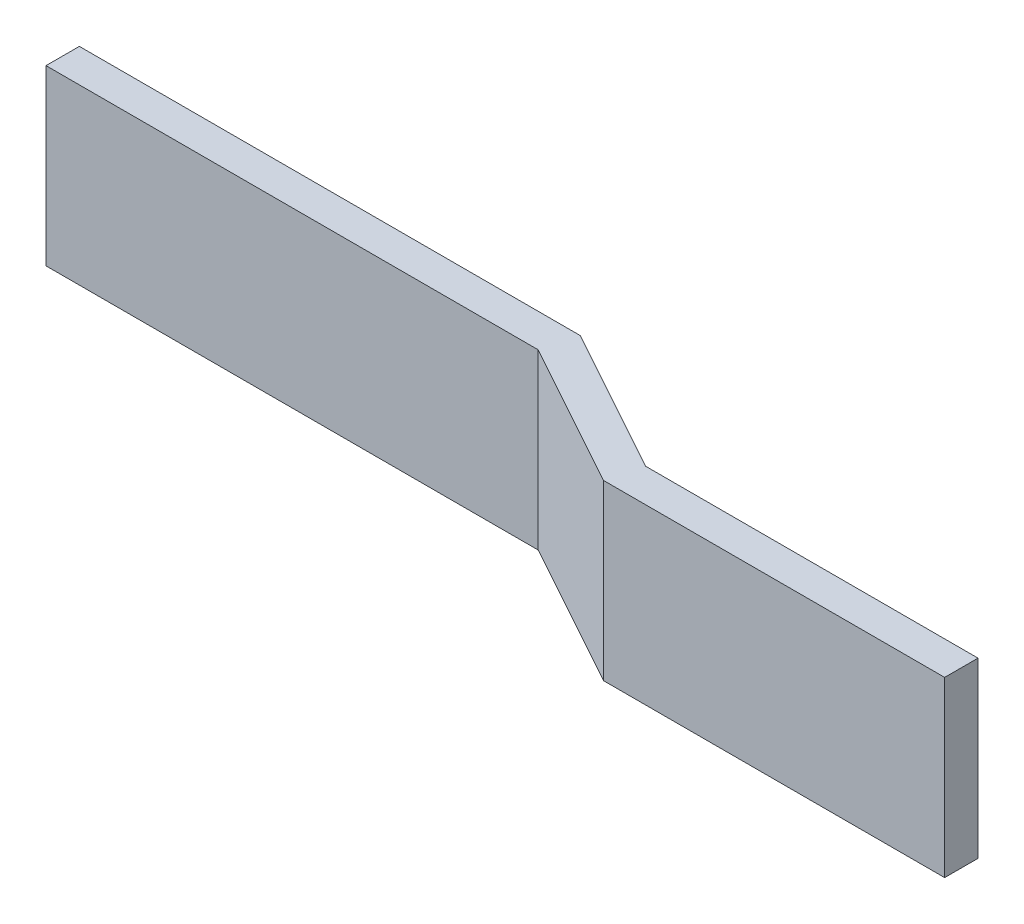
ISO-10303-21;
HEADER;
FILE_DESCRIPTION(('STEP AP214'),'2;1');
FILE_NAME('part.step','',(''),(''),'','','');
FILE_SCHEMA(('AUTOMOTIVE_DESIGN { 1 0 10303 214 1 1 1 1 }'));
ENDSEC;
DATA;
#1=APPLICATION_CONTEXT('core data for automotive mechanical design processes');
#2=APPLICATION_PROTOCOL_DEFINITION('international standard','automotive_design',2000,#1);
#3=PRODUCT_CONTEXT('',#1,'mechanical');
#4=PRODUCT('Part','Part','',(#3));
#5=PRODUCT_RELATED_PRODUCT_CATEGORY('part','',(#4));
#6=PRODUCT_DEFINITION_FORMATION('','',#4);
#7=PRODUCT_DEFINITION_CONTEXT('part definition',#1,'design');
#8=PRODUCT_DEFINITION('design','',#6,#7);
#9=PRODUCT_DEFINITION_SHAPE('','',#8);
#10=(LENGTH_UNIT() NAMED_UNIT(*) SI_UNIT(.MILLI.,.METRE.));
#11=(NAMED_UNIT(*) PLANE_ANGLE_UNIT() SI_UNIT($,.RADIAN.));
#12=(NAMED_UNIT(*) SI_UNIT($,.STERADIAN.) SOLID_ANGLE_UNIT());
#13=UNCERTAINTY_MEASURE_WITH_UNIT(LENGTH_MEASURE(1.E-05),#10,'distance_accuracy_value','');
#14=(GEOMETRIC_REPRESENTATION_CONTEXT(3) GLOBAL_UNCERTAINTY_ASSIGNED_CONTEXT((#13)) GLOBAL_UNIT_ASSIGNED_CONTEXT((#10,
#11,#12)) REPRESENTATION_CONTEXT('',''));
#15=CARTESIAN_POINT('',(0.,0.,0.));
#16=DIRECTION('',(0.,0.,1.));
#17=DIRECTION('',(1.,0.,0.));
#18=AXIS2_PLACEMENT_3D('',#15,#16,#17);
#19=CARTESIAN_POINT('',(49.2452703940796,13.208,8.66886869750178));
#20=DIRECTION('',(0.,0.,-1.));
#21=DIRECTION('',(-1.,0.,0.));
#22=AXIS2_PLACEMENT_3D('',#19,#20,#21);
#23=PLANE('',#22);
#24=DIRECTION('',(1.,0.,0.));
#25=VECTOR('',#24,1.);
#26=CARTESIAN_POINT('',(49.2452703940796,0.,8.66886869750178));
#27=LINE('',#26,#25);
#28=CARTESIAN_POINT('',(48.5909413517748,0.,8.66886869750178));
#29=VERTEX_POINT('',#28);
#30=CARTESIAN_POINT('',(74.5674344132872,0.,8.66886869750178));
#31=VERTEX_POINT('',#30);
#32=EDGE_CURVE('E141',#29,#31,#27,.T.);
#33=ORIENTED_EDGE('',*,*,#32,.T.);
#34=DIRECTION('',(0.,-1.,0.));
#35=VECTOR('',#34,1.);
#36=CARTESIAN_POINT('',(74.5674344132872,13.208,8.66886869750178));
#37=LINE('',#36,#35);
#38=CARTESIAN_POINT('',(74.5674344132872,13.208,8.66886869750178));
#39=VERTEX_POINT('',#38);
#40=EDGE_CURVE('E11',#39,#31,#37,.T.);
#41=ORIENTED_EDGE('',*,*,#40,.F.);
#42=DIRECTION('',(1.,0.,0.));
#43=VECTOR('',#42,1.);
#44=CARTESIAN_POINT('',(49.2452703940796,13.208,8.66886869750178));
#45=LINE('',#44,#43);
#46=CARTESIAN_POINT('',(48.5909413517748,13.208,8.66886869750178));
#47=VERTEX_POINT('',#46);
#48=EDGE_CURVE('E94',#47,#39,#45,.T.);
#49=ORIENTED_EDGE('',*,*,#48,.F.);
#50=DIRECTION('',(0.,-1.,0.));
#51=VECTOR('',#50,1.);
#52=CARTESIAN_POINT('',(48.5909413517748,13.208,8.66886869750178));
#53=LINE('',#52,#51);
#54=EDGE_CURVE('E140',#47,#29,#53,.T.);
#55=ORIENTED_EDGE('',*,*,#54,.T.);
#56=EDGE_LOOP('',(#33,#41,#49,#55));
#57=FACE_BOUND('',#56,.T.);
#58=ADVANCED_FACE('F38',(#57),#23,.F.);
#59=CARTESIAN_POINT('',(74.5674344132872,13.208,6.12886869750177));
#60=DIRECTION('',(1.,0.,0.));
#61=DIRECTION('',(0.,0.,-1.));
#62=AXIS2_PLACEMENT_3D('',#59,#60,#61);
#63=PLANE('',#62);
#64=DIRECTION('',(0.,0.,1.));
#65=VECTOR('',#64,1.);
#66=CARTESIAN_POINT('',(74.5674344132872,0.,6.12886869750177));
#67=LINE('',#66,#65);
#68=CARTESIAN_POINT('',(74.5674344132872,0.,6.12886869750177));
#69=VERTEX_POINT('',#68);
#70=EDGE_CURVE('E145',#69,#31,#67,.T.);
#71=ORIENTED_EDGE('',*,*,#70,.F.);
#72=DIRECTION('',(0.,-1.,0.));
#73=VECTOR('',#72,1.);
#74=CARTESIAN_POINT('',(74.5674344132872,13.208,6.12886869750177));
#75=LINE('',#74,#73);
#76=CARTESIAN_POINT('',(74.5674344132872,13.208,6.12886869750177));
#77=VERTEX_POINT('',#76);
#78=EDGE_CURVE('E47',#77,#69,#75,.T.);
#79=ORIENTED_EDGE('',*,*,#78,.F.);
#80=DIRECTION('',(0.,0.,1.));
#81=VECTOR('',#80,1.);
#82=CARTESIAN_POINT('',(74.5674344132872,13.208,6.12886869750177));
#83=LINE('',#82,#81);
#84=EDGE_CURVE('E198',#77,#39,#83,.T.);
#85=ORIENTED_EDGE('',*,*,#84,.T.);
#86=ORIENTED_EDGE('',*,*,#40,.T.);
#87=EDGE_LOOP('',(#71,#79,#85,#86));
#88=FACE_BOUND('',#87,.T.);
#89=ADVANCED_FACE('F189',(#88),#63,.T.);
#90=CARTESIAN_POINT('',(49.2452703940796,13.208,6.12886869750177));
#91=DIRECTION('',(0.,0.,-1.));
#92=DIRECTION('',(-1.,0.,0.));
#93=AXIS2_PLACEMENT_3D('',#90,#91,#92);
#94=PLANE('',#93);
#95=DIRECTION('',(1.,0.,0.));
#96=VECTOR('',#95,1.);
#97=CARTESIAN_POINT('',(49.2452703940796,0.,6.12886869750177));
#98=LINE('',#97,#96);
#99=CARTESIAN_POINT('',(49.2452703940796,0.,6.12886869750177));
#100=VERTEX_POINT('',#99);
#101=EDGE_CURVE('E150',#100,#69,#98,.T.);
#102=ORIENTED_EDGE('',*,*,#101,.F.);
#103=DIRECTION('',(0.,-1.,0.));
#104=VECTOR('',#103,1.);
#105=CARTESIAN_POINT('',(49.2452703940796,13.208,6.12886869750177));
#106=LINE('',#105,#104);
#107=CARTESIAN_POINT('',(49.2452703940796,13.208,6.12886869750177));
#108=VERTEX_POINT('',#107);
#109=EDGE_CURVE('E177',#108,#100,#106,.T.);
#110=ORIENTED_EDGE('',*,*,#109,.F.);
#111=DIRECTION('',(1.,0.,0.));
#112=VECTOR('',#111,1.);
#113=CARTESIAN_POINT('',(49.2452703940796,13.208,6.12886869750177));
#114=LINE('',#113,#112);
#115=EDGE_CURVE('E186',#108,#77,#114,.T.);
#116=ORIENTED_EDGE('',*,*,#115,.T.);
#117=ORIENTED_EDGE('',*,*,#78,.T.);
#118=EDGE_LOOP('',(#102,#110,#116,#117));
#119=FACE_BOUND('',#118,.T.);
#120=ADVANCED_FACE('F184',(#119),#94,.T.);
#121=CARTESIAN_POINT('',(38.1390581049535,13.208,0.));
#122=DIRECTION('',(0.483156107137484,0.,-0.875534223280708));
#123=DIRECTION('',(-0.875534223280708,0.,-0.483156107137484));
#124=AXIS2_PLACEMENT_3D('',#121,#122,#123);
#125=PLANE('',#124);
#126=DIRECTION('',(0.875534223280708,0.,0.483156107137484));
#127=VECTOR('',#126,1.);
#128=CARTESIAN_POINT('',(38.1390581049535,0.,0.));
#129=LINE('',#128,#127);
#130=CARTESIAN_POINT('',(38.1390581049535,0.,0.));
#131=VERTEX_POINT('',#130);
#132=EDGE_CURVE('E154',#131,#100,#129,.T.);
#133=ORIENTED_EDGE('',*,*,#132,.F.);
#134=DIRECTION('',(0.,-1.,0.));
#135=VECTOR('',#134,1.);
#136=CARTESIAN_POINT('',(38.1390581049535,13.208,0.));
#137=LINE('',#136,#135);
#138=CARTESIAN_POINT('',(38.1390581049535,13.208,0.));
#139=VERTEX_POINT('',#138);
#140=EDGE_CURVE('E174',#139,#131,#137,.T.);
#141=ORIENTED_EDGE('',*,*,#140,.F.);
#142=DIRECTION('',(0.875534223280708,0.,0.483156107137484));
#143=VECTOR('',#142,1.);
#144=CARTESIAN_POINT('',(38.1390581049535,13.208,0.));
#145=LINE('',#144,#143);
#146=EDGE_CURVE('E134',#139,#108,#145,.T.);
#147=ORIENTED_EDGE('',*,*,#146,.T.);
#148=ORIENTED_EDGE('',*,*,#109,.T.);
#149=EDGE_LOOP('',(#133,#141,#147,#148));
#150=FACE_BOUND('',#149,.T.);
#151=ADVANCED_FACE('F196',(#150),#125,.T.);
#152=CARTESIAN_POINT('',(0.,13.208,0.));
#153=DIRECTION('',(0.,0.,-1.));
#154=DIRECTION('',(-1.,0.,0.));
#155=AXIS2_PLACEMENT_3D('',#152,#153,#154);
#156=PLANE('',#155);
#157=CARTESIAN_POINT('',(6.11062579811326,6.604,0.));
#158=DIRECTION('',(0.,0.,-1.));
#159=DIRECTION('',(-1.,0.,0.));
#160=AXIS2_PLACEMENT_3D('',#157,#158,#159);
#161=CIRCLE('',#160,3.048);
#162=CARTESIAN_POINT('',(3.06262579811326,6.604,0.));
#163=VERTEX_POINT('',#162);
#164=EDGE_CURVE('E207',#163,#163,#161,.T.);
#165=ORIENTED_EDGE('',*,*,#164,.F.);
#166=EDGE_LOOP('',(#165));
#167=FACE_BOUND('',#166,.T.);
#168=DIRECTION('',(1.,0.,0.));
#169=VECTOR('',#168,1.);
#170=CARTESIAN_POINT('',(0.,0.,0.));
#171=LINE('',#170,#169);
#172=CARTESIAN_POINT('',(0.,0.,0.));
#173=VERTEX_POINT('',#172);
#174=EDGE_CURVE('E158',#173,#131,#171,.T.);
#175=ORIENTED_EDGE('',*,*,#174,.F.);
#176=DIRECTION('',(0.,-1.,0.));
#177=VECTOR('',#176,1.);
#178=CARTESIAN_POINT('',(0.,13.208,0.));
#179=LINE('',#178,#177);
#180=CARTESIAN_POINT('',(0.,13.208,0.));
#181=VERTEX_POINT('',#180);
#182=EDGE_CURVE('E119',#181,#173,#179,.T.);
#183=ORIENTED_EDGE('',*,*,#182,.F.);
#184=DIRECTION('',(1.,0.,0.));
#185=VECTOR('',#184,1.);
#186=CARTESIAN_POINT('',(0.,13.208,0.));
#187=LINE('',#186,#185);
#188=EDGE_CURVE('E130',#181,#139,#187,.T.);
#189=ORIENTED_EDGE('',*,*,#188,.T.);
#190=ORIENTED_EDGE('',*,*,#140,.T.);
#191=EDGE_LOOP('',(#175,#183,#189,#190));
#192=FACE_BOUND('',#191,.T.);
#193=ADVANCED_FACE('F223',(#167,#192),#156,.T.);
#194=CARTESIAN_POINT('',(0.,13.208,2.54));
#195=DIRECTION('',(-1.,0.,0.));
#196=DIRECTION('',(0.,0.,1.));
#197=AXIS2_PLACEMENT_3D('',#194,#195,#196);
#198=PLANE('',#197);
#199=DIRECTION('',(0.,0.,-1.));
#200=VECTOR('',#199,1.);
#201=CARTESIAN_POINT('',(0.,0.,2.54));
#202=LINE('',#201,#200);
#203=CARTESIAN_POINT('',(0.,0.,2.54));
#204=VERTEX_POINT('',#203);
#205=EDGE_CURVE('E117',#204,#173,#202,.T.);
#206=ORIENTED_EDGE('',*,*,#205,.F.);
#207=DIRECTION('',(0.,-1.,0.));
#208=VECTOR('',#207,1.);
#209=CARTESIAN_POINT('',(0.,13.208,2.54));
#210=LINE('',#209,#208);
#211=CARTESIAN_POINT('',(0.,13.208,2.54));
#212=VERTEX_POINT('',#211);
#213=EDGE_CURVE('E111',#212,#204,#210,.T.);
#214=ORIENTED_EDGE('',*,*,#213,.F.);
#215=DIRECTION('',(0.,0.,-1.));
#216=VECTOR('',#215,1.);
#217=CARTESIAN_POINT('',(0.,13.208,2.54));
#218=LINE('',#217,#216);
#219=EDGE_CURVE('E115',#212,#181,#218,.T.);
#220=ORIENTED_EDGE('',*,*,#219,.T.);
#221=ORIENTED_EDGE('',*,*,#182,.T.);
#222=EDGE_LOOP('',(#206,#214,#220,#221));
#223=FACE_BOUND('',#222,.T.);
#224=ADVANCED_FACE('F113',(#223),#198,.T.);
#225=CARTESIAN_POINT('',(0.,13.208,2.54));
#226=DIRECTION('',(0.,0.,-1.));
#227=DIRECTION('',(-1.,0.,0.));
#228=AXIS2_PLACEMENT_3D('',#225,#226,#227);
#229=PLANE('',#228);
#230=DIRECTION('',(1.,0.,0.));
#231=VECTOR('',#230,1.);
#232=CARTESIAN_POINT('',(0.,0.,2.54));
#233=LINE('',#232,#231);
#234=CARTESIAN_POINT('',(37.4847290626487,0.,2.54));
#235=VERTEX_POINT('',#234);
#236=EDGE_CURVE('E82',#204,#235,#233,.T.);
#237=ORIENTED_EDGE('',*,*,#236,.T.);
#238=DIRECTION('',(0.,-1.,0.));
#239=VECTOR('',#238,1.);
#240=CARTESIAN_POINT('',(37.4847290626487,13.208,2.54));
#241=LINE('',#240,#239);
#242=CARTESIAN_POINT('',(37.4847290626487,13.208,2.54));
#243=VERTEX_POINT('',#242);
#244=EDGE_CURVE('E120',#243,#235,#241,.T.);
#245=ORIENTED_EDGE('',*,*,#244,.F.);
#246=DIRECTION('',(1.,0.,0.));
#247=VECTOR('',#246,1.);
#248=CARTESIAN_POINT('',(0.,13.208,2.54));
#249=LINE('',#248,#247);
#250=EDGE_CURVE('E122',#212,#243,#249,.T.);
#251=ORIENTED_EDGE('',*,*,#250,.F.);
#252=ORIENTED_EDGE('',*,*,#213,.T.);
#253=EDGE_LOOP('',(#237,#245,#251,#252));
#254=FACE_BOUND('',#253,.T.);
#255=ADVANCED_FACE('F123',(#254),#229,.F.);
#256=CARTESIAN_POINT('',(36.9118415928243,13.208,2.223856927133));
#257=DIRECTION('',(0.483156107137484,0.,-0.875534223280708));
#258=DIRECTION('',(-0.875534223280708,0.,-0.483156107137484));
#259=AXIS2_PLACEMENT_3D('',#256,#257,#258);
#260=PLANE('',#259);
#261=DIRECTION('',(0.875534223280708,0.,0.483156107137484));
#262=VECTOR('',#261,1.);
#263=CARTESIAN_POINT('',(36.9118415928243,0.,2.223856927133));
#264=LINE('',#263,#262);
#265=EDGE_CURVE('E88',#235,#29,#264,.T.);
#266=ORIENTED_EDGE('',*,*,#265,.T.);
#267=ORIENTED_EDGE('',*,*,#54,.F.);
#268=DIRECTION('',(0.875534223280708,0.,0.483156107137484));
#269=VECTOR('',#268,1.);
#270=CARTESIAN_POINT('',(36.9118415928243,13.208,2.223856927133));
#271=LINE('',#270,#269);
#272=EDGE_CURVE('E55',#243,#47,#271,.T.);
#273=ORIENTED_EDGE('',*,*,#272,.F.);
#274=ORIENTED_EDGE('',*,*,#244,.T.);
#275=EDGE_LOOP('',(#266,#267,#273,#274));
#276=FACE_BOUND('',#275,.T.);
#277=ADVANCED_FACE('F228',(#276),#260,.F.);
#278=CARTESIAN_POINT('',(0.,13.208,0.));
#279=DIRECTION('',(0.,-1.,0.));
#280=DIRECTION('',(-1.,0.,0.));
#281=AXIS2_PLACEMENT_3D('',#278,#279,#280);
#282=PLANE('',#281);
#283=ORIENTED_EDGE('',*,*,#48,.T.);
#284=ORIENTED_EDGE('',*,*,#84,.F.);
#285=ORIENTED_EDGE('',*,*,#115,.F.);
#286=ORIENTED_EDGE('',*,*,#146,.F.);
#287=ORIENTED_EDGE('',*,*,#188,.F.);
#288=ORIENTED_EDGE('',*,*,#219,.F.);
#289=ORIENTED_EDGE('',*,*,#250,.T.);
#290=ORIENTED_EDGE('',*,*,#272,.T.);
#291=EDGE_LOOP('',(#283,#284,#285,#286,#287,#288,#289,#290));
#292=FACE_BOUND('',#291,.T.);
#293=ADVANCED_FACE('F127',(#292),#282,.F.);
#294=CARTESIAN_POINT('',(0.,0.,0.));
#295=DIRECTION('',(0.,-1.,0.));
#296=DIRECTION('',(-1.,0.,0.));
#297=AXIS2_PLACEMENT_3D('',#294,#295,#296);
#298=PLANE('',#297);
#299=ORIENTED_EDGE('',*,*,#32,.F.);
#300=ORIENTED_EDGE('',*,*,#265,.F.);
#301=ORIENTED_EDGE('',*,*,#236,.F.);
#302=ORIENTED_EDGE('',*,*,#205,.T.);
#303=ORIENTED_EDGE('',*,*,#174,.T.);
#304=ORIENTED_EDGE('',*,*,#132,.T.);
#305=ORIENTED_EDGE('',*,*,#101,.T.);
#306=ORIENTED_EDGE('',*,*,#70,.T.);
#307=EDGE_LOOP('',(#299,#300,#301,#302,#303,#304,#305,#306));
#308=FACE_BOUND('',#307,.T.);
#309=ADVANCED_FACE('F192',(#308),#298,.T.);
#310=CARTESIAN_POINT('',(6.11062579811326,6.604,1.27));
#311=DIRECTION('',(0.,0.,-1.));
#312=DIRECTION('',(-1.,0.,0.));
#313=AXIS2_PLACEMENT_3D('',#310,#311,#312);
#314=CYLINDRICAL_SURFACE('',#313,3.048);
#315=CARTESIAN_POINT('',(6.11062579811326,6.604,1.27));
#316=DIRECTION('',(0.,0.,-1.));
#317=DIRECTION('',(-1.,0.,0.));
#318=AXIS2_PLACEMENT_3D('',#315,#316,#317);
#319=CIRCLE('',#318,3.048);
#320=CARTESIAN_POINT('',(3.06262579811326,6.604,1.27));
#321=VERTEX_POINT('',#320);
#322=EDGE_CURVE('E146',#321,#321,#319,.T.);
#323=ORIENTED_EDGE('',*,*,#322,.F.);
#324=EDGE_LOOP('',(#323));
#325=FACE_BOUND('',#324,.T.);
#326=ORIENTED_EDGE('',*,*,#164,.T.);
#327=EDGE_LOOP('',(#326));
#328=FACE_BOUND('',#327,.T.);
#329=ADVANCED_FACE('F217',(#325,#328),#314,.F.);
#330=CARTESIAN_POINT('',(6.11062579811326,6.604,1.27));
#331=DIRECTION('',(0.,0.,-1.));
#332=DIRECTION('',(-1.,0.,0.));
#333=AXIS2_PLACEMENT_3D('',#330,#331,#332);
#334=PLANE('',#333);
#335=ORIENTED_EDGE('',*,*,#322,.T.);
#336=EDGE_LOOP('',(#335));
#337=FACE_BOUND('',#336,.T.);
#338=ADVANCED_FACE('F215',(#337),#334,.T.);
#339=CLOSED_SHELL('',(#58,#89,#120,#151,#193,#224,#255,#277,#293,#309,#329,#338));
#340=MANIFOLD_SOLID_BREP('B2',#339);
#341=ADVANCED_BREP_SHAPE_REPRESENTATION('',(#18,#340),#14);
#342=SHAPE_DEFINITION_REPRESENTATION(#9,#341);
ENDSEC;
END-ISO-10303-21;
